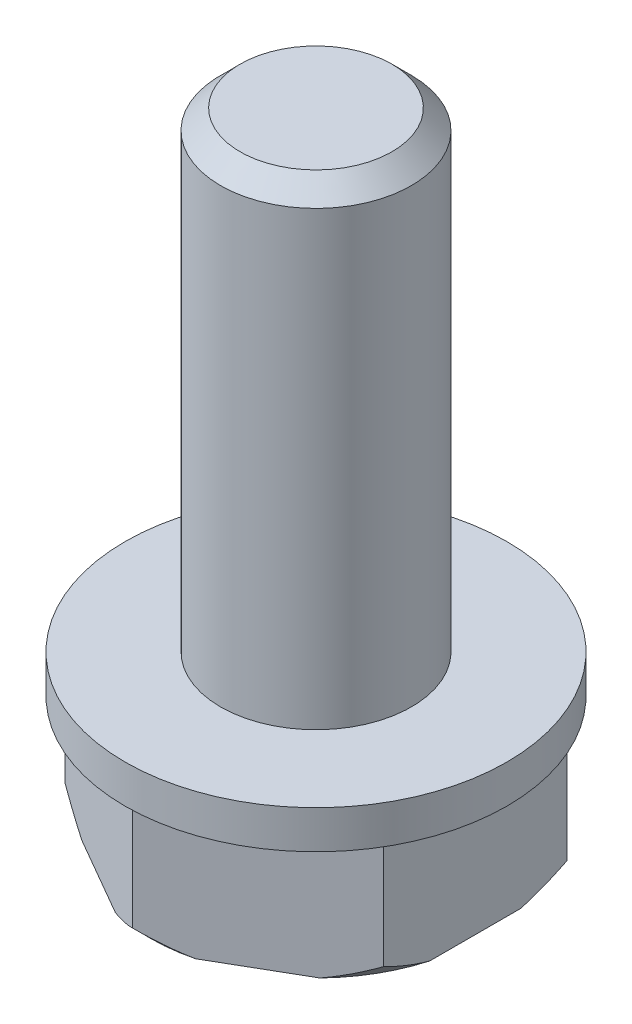
ISO-10303-21;
HEADER;
FILE_DESCRIPTION(('STEP AP214'),'2;1');
FILE_NAME('part.step','',(''),(''),'','','');
FILE_SCHEMA(('AUTOMOTIVE_DESIGN { 1 0 10303 214 1 1 1 1 }'));
ENDSEC;
DATA;
#1=APPLICATION_CONTEXT('core data for automotive mechanical design processes');
#2=APPLICATION_PROTOCOL_DEFINITION('international standard','automotive_design',2000,#1);
#3=PRODUCT_CONTEXT('',#1,'mechanical');
#4=PRODUCT('Part','Part','',(#3));
#5=PRODUCT_RELATED_PRODUCT_CATEGORY('part','',(#4));
#6=PRODUCT_DEFINITION_FORMATION('','',#4);
#7=PRODUCT_DEFINITION_CONTEXT('part definition',#1,'design');
#8=PRODUCT_DEFINITION('design','',#6,#7);
#9=PRODUCT_DEFINITION_SHAPE('','',#8);
#10=(LENGTH_UNIT() NAMED_UNIT(*) SI_UNIT(.MILLI.,.METRE.));
#11=(NAMED_UNIT(*) PLANE_ANGLE_UNIT() SI_UNIT($,.RADIAN.));
#12=(NAMED_UNIT(*) SI_UNIT($,.STERADIAN.) SOLID_ANGLE_UNIT());
#13=UNCERTAINTY_MEASURE_WITH_UNIT(LENGTH_MEASURE(1.E-05),#10,'distance_accuracy_value','');
#14=(GEOMETRIC_REPRESENTATION_CONTEXT(3) GLOBAL_UNCERTAINTY_ASSIGNED_CONTEXT((#13)) GLOBAL_UNIT_ASSIGNED_CONTEXT((#10,
#11,#12)) REPRESENTATION_CONTEXT('',''));
#15=CARTESIAN_POINT('',(0.,0.,0.));
#16=DIRECTION('',(0.,0.,1.));
#17=DIRECTION('',(1.,0.,0.));
#18=AXIS2_PLACEMENT_3D('',#15,#16,#17);
#19=CARTESIAN_POINT('',(-12.6776695296637,96.,14.7909181837156));
#20=DIRECTION('',(-0.5,0.,0.866025403784439));
#21=DIRECTION('',(0.866025403784439,0.,0.5));
#22=AXIS2_PLACEMENT_3D('',#19,#20,#21);
#23=PLANE('',#22);
#24=DIRECTION('',(0.,-1.,0.));
#25=VECTOR('',#24,1.);
#26=CARTESIAN_POINT('',(-12.6776695296637,96.,14.7909181837156));
#27=LINE('',#26,#25);
#28=CARTESIAN_POINT('',(-12.6776695296637,50.,14.7909181837156));
#29=VERTEX_POINT('',#28);
#30=CARTESIAN_POINT('',(-12.6776695296637,46.5735026918963,14.7909181837156));
#31=VERTEX_POINT('',#30);
#32=EDGE_CURVE('E11',#29,#31,#27,.T.);
#33=ORIENTED_EDGE('',*,*,#32,.T.);
#34=CARTESIAN_POINT('',(-13.9407378419784,46.,14.0616853535958));
#35=CARTESIAN_POINT('',(-13.8888852998626,46.0164440766261,14.091623938227));
#36=CARTESIAN_POINT('',(-13.8372495435169,46.0337687545802,14.1214486324146));
#37=CARTESIAN_POINT('',(-13.7338516018748,46.0702823086314,14.1811796574282));
#38=CARTESIAN_POINT('',(-13.6820943622336,46.0894897238432,14.2110832271335));
#39=CARTESIAN_POINT('',(-13.5783633971793,46.1297670931507,14.2710096812821));
#40=CARTESIAN_POINT('',(-13.5263958373999,46.1508582920278,14.3010289273304));
#41=CARTESIAN_POINT('',(-13.4221600511645,46.1949003649628,14.3612296351021));
#42=CARTESIAN_POINT('',(-13.3698991333133,46.2178745106764,14.3914067018588));
#43=CARTESIAN_POINT('',(-13.2649997798865,46.2656807395659,14.4519664939412));
#44=CARTESIAN_POINT('',(-13.212369709376,46.2905375181192,14.4823441822286));
#45=CARTESIAN_POINT('',(-13.1066617384088,46.3421079012049,14.5433494931069));
#46=CARTESIAN_POINT('',(-13.0535931424492,46.3688470805479,14.5739715894766));
#47=CARTESIAN_POINT('',(-12.9469443837856,46.4241810640024,14.6355096377957));
#48=CARTESIAN_POINT('',(-12.8933743396931,46.4528018406309,14.6664197250956));
#49=CARTESIAN_POINT('',(-12.7856642307774,46.5119007649667,14.7285774640249));
#50=CARTESIAN_POINT('',(-12.7315349477506,46.5424049416879,14.7598190718213));
#51=CARTESIAN_POINT('',(-12.6776695296637,46.5735026918963,14.7909181837156));
#52=B_SPLINE_CURVE_WITH_KNOTS('',3,(#34,#35,#36,#37,#38,#39,#40,#41,#42,#43,#44,#45,#46,#47,#48,
#49,#50,#51),.UNSPECIFIED.,.F.,.F.,(4,2,2,2,2,2,2,2,4),(0.,0.186265222277087,0.374595608167021,
0.565412784427934,0.759111232115696,0.956057798253864,1.15659171756842,1.36102506604504,
1.56964356219137),.UNSPECIFIED.);
#53=CARTESIAN_POINT('',(-13.9407378419784,46.,14.0616853535958));
#54=VERTEX_POINT('',#53);
#55=EDGE_CURVE('E126',#54,#31,#52,.T.);
#56=ORIENTED_EDGE('',*,*,#55,.F.);
#57=DIRECTION('',(0.866025403784439,0.,0.5));
#58=VECTOR('',#57,1.);
#59=CARTESIAN_POINT('',(-11.2776695296637,46.,15.5992085605811));
#60=LINE('',#59,#58);
#61=CARTESIAN_POINT('',(-16.414601217349,46.,12.6333996678872));
#62=VERTEX_POINT('',#61);
#63=EDGE_CURVE('E147',#62,#54,#60,.T.);
#64=ORIENTED_EDGE('',*,*,#63,.F.);
#65=CARTESIAN_POINT('',(-17.6776695296637,46.5735026918963,11.9041668377674));
#66=CARTESIAN_POINT('',(-17.6238041996847,46.5424049416879,11.9352661022691));
#67=CARTESIAN_POINT('',(-17.5696835321645,46.5119007649667,11.9665226325607));
#68=CARTESIAN_POINT('',(-17.4619982967521,46.4528018406309,12.0287234536614));
#69=CARTESIAN_POINT('',(-17.4084443538709,46.4241810640024,12.0596614290774));
#70=CARTESIAN_POINT('',(-17.3018264613955,46.3688470805479,12.1212529392026));
#71=CARTESIAN_POINT('',(-17.2487726500423,46.3421079012049,12.1519006432619));
#72=CARTESIAN_POINT('',(-17.1430865155724,46.2905375181192,12.2129437760629));
#73=CARTESIAN_POINT('',(-17.090463630552,46.2656807395659,12.2433339099843));
#74=CARTESIAN_POINT('',(-16.9855676354473,46.2178745106764,12.3038995188512));
#75=CARTESIAN_POINT('',(-16.9333030700988,46.1949003649628,12.3340702679571));
#76=CARTESIAN_POINT('',(-16.829049834725,46.1508582920278,12.3942407529346));
#77=CARTESIAN_POINT('',(-16.7770686251549,46.1297670931507,12.424236356852));
#78=CARTESIAN_POINT('',(-16.6733053109764,46.0894897238432,12.4841067806739));
#79=CARTESIAN_POINT('',(-16.6215294401272,46.0702823086314,12.5139780801803));
#80=CARTESIAN_POINT('',(-16.5181018842503,46.0337687545802,12.5736578118346));
#81=CARTESIAN_POINT('',(-16.4664550632509,46.0164440766261,12.6034633414798));
#82=CARTESIAN_POINT('',(-16.414601217349,46.,12.6333996678872));
#83=B_SPLINE_CURVE_WITH_KNOTS('',3,(#65,#66,#67,#68,#69,#70,#71,#72,#73,#74,#75,#76,#77,#78,#79,
#80,#81,#82),.UNSPECIFIED.,.F.,.F.,(4,2,2,2,2,2,2,2,4),(0.,0.208618496146344,0.413051844622972,
0.613585763937534,0.810532330075705,1.00423077776347,1.19504795402439,1.38337833991431,
1.56964356219139),.UNSPECIFIED.);
#84=CARTESIAN_POINT('',(-17.6776695296637,46.5735026918963,11.9041668377674));
#85=VERTEX_POINT('',#84);
#86=EDGE_CURVE('E341',#85,#62,#83,.T.);
#87=ORIENTED_EDGE('',*,*,#86,.F.);
#88=DIRECTION('',(0.,-1.,0.));
#89=VECTOR('',#88,1.);
#90=CARTESIAN_POINT('',(-17.6776695296637,96.,11.9041668377674));
#91=LINE('',#90,#89);
#92=CARTESIAN_POINT('',(-17.6776695296637,50.,11.9041668377674));
#93=VERTEX_POINT('',#92);
#94=EDGE_CURVE('E365',#93,#85,#91,.T.);
#95=ORIENTED_EDGE('',*,*,#94,.F.);
#96=DIRECTION('',(-0.866025403784439,0.,-0.5));
#97=VECTOR('',#96,1.);
#98=CARTESIAN_POINT('',(-12.9276695296637,50.,14.6465806164181));
#99=LINE('',#98,#97);
#100=EDGE_CURVE('E352',#29,#93,#99,.T.);
#101=ORIENTED_EDGE('',*,*,#100,.F.);
#102=EDGE_LOOP('',(#33,#56,#64,#87,#95,#101));
#103=FACE_BOUND('',#102,.T.);
#104=ADVANCED_FACE('F16',(#103),#23,.F.);
#105=CARTESIAN_POINT('',(-12.6776695296637,96.,20.5644208756118));
#106=DIRECTION('',(-1.,0.,0.));
#107=DIRECTION('',(0.,0.,1.));
#108=AXIS2_PLACEMENT_3D('',#105,#106,#107);
#109=PLANE('',#108);
#110=DIRECTION('',(0.,-1.,0.));
#111=VECTOR('',#110,1.);
#112=CARTESIAN_POINT('',(-12.6776695296637,96.,20.5644208756118));
#113=LINE('',#112,#111);
#114=CARTESIAN_POINT('',(-12.6776695296637,50.,20.5644208756118));
#115=VERTEX_POINT('',#114);
#116=CARTESIAN_POINT('',(-12.6776695296637,46.5735026918963,20.5644208756118));
#117=VERTEX_POINT('',#116);
#118=EDGE_CURVE('E214',#115,#117,#113,.T.);
#119=ORIENTED_EDGE('',*,*,#118,.T.);
#120=CARTESIAN_POINT('',(-12.6776695296637,46.,19.1059552153723));
#121=CARTESIAN_POINT('',(-12.6776708334498,46.0164440766261,19.1658301264109));
#122=CARTESIAN_POINT('',(-12.6776818981035,46.0337687545802,19.2254603502437));
#123=CARTESIAN_POINT('',(-12.6777115123383,46.0702823086314,19.3448711069116));
#124=CARTESIAN_POINT('',(-12.6777301435463,46.0894897238432,19.4046459761233));
#125=CARTESIAN_POINT('',(-12.6777624926705,46.1297670931507,19.5244428540937));
#126=CARTESIAN_POINT('',(-12.6777761424612,46.1508582920278,19.5844577040596));
#127=CARTESIAN_POINT('',(-12.6777935915996,46.1949003649628,19.7048288968087));
#128=CARTESIAN_POINT('',(-12.677797239097,46.2178745106764,19.7651767126713));
#129=CARTESIAN_POINT('',(-12.6777938807748,46.2656807395659,19.8863021136206));
#130=CARTESIAN_POINT('',(-12.6777866952847,46.2905375181192,19.9470699358293));
#131=CARTESIAN_POINT('',(-12.6777648587874,46.3421079012049,20.0691183795086));
#132=CARTESIAN_POINT('',(-12.677750074181,46.3688470805479,20.1303881799377));
#133=CARTESIAN_POINT('',(-12.6777192079928,46.4241810640024,20.2535177383819));
#134=CARTESIAN_POINT('',(-12.6777031067814,46.4528018406309,20.3153658010979));
#135=CARTESIAN_POINT('',(-12.6776782332782,46.5119007649667,20.4397243611279));
#136=CARTESIAN_POINT('',(-12.6776696177716,46.542404941688,20.502222499216));
#137=CARTESIAN_POINT('',(-12.6776695296637,46.5735026918963,20.5644208756118));
#138=B_SPLINE_CURVE_WITH_KNOTS('',3,(#120,#121,#122,#123,#124,#125,#126,#127,#128,#129,#130,
#131,#132,#133,#134,#135,#136,#137),.UNSPECIFIED.,.F.,.F.,(4,2,2,2,2,2,2,2,4),(0.,
0.186265222277086,0.37459560816702,0.565412784427932,0.759111232115696,0.956057798253867,
1.15659171756843,1.36102506604505,1.56964356219139),.UNSPECIFIED.);
#139=CARTESIAN_POINT('',(-12.6776695296637,46.,19.1059552153723));
#140=VERTEX_POINT('',#139);
#141=EDGE_CURVE('E28',#140,#117,#138,.T.);
#142=ORIENTED_EDGE('',*,*,#141,.F.);
#143=DIRECTION('',(0.,0.,1.));
#144=VECTOR('',#143,1.);
#145=CARTESIAN_POINT('',(-12.6776695296637,46.,17.6776695296637));
#146=LINE('',#145,#144);
#147=CARTESIAN_POINT('',(-12.6776695296637,46.,16.2493838439551));
#148=VERTEX_POINT('',#147);
#149=EDGE_CURVE('E133',#148,#140,#146,.T.);
#150=ORIENTED_EDGE('',*,*,#149,.F.);
#151=CARTESIAN_POINT('',(-12.6776695296637,46.5735026918963,14.7909181837156));
#152=CARTESIAN_POINT('',(-12.6776696177716,46.5424049416879,14.8531165601115));
#153=CARTESIAN_POINT('',(-12.6776782332782,46.5119007649667,14.9156146981996));
#154=CARTESIAN_POINT('',(-12.6777031067814,46.4528018406309,15.0399732582295));
#155=CARTESIAN_POINT('',(-12.6777192079928,46.4241810640024,15.1018213209455));
#156=CARTESIAN_POINT('',(-12.677750074181,46.3688470805479,15.2249508793897));
#157=CARTESIAN_POINT('',(-12.6777648587874,46.3421079012049,15.2862206798188));
#158=CARTESIAN_POINT('',(-12.6777866952847,46.2905375181192,15.4082691234981));
#159=CARTESIAN_POINT('',(-12.6777938807748,46.2656807395659,15.4690369457068));
#160=CARTESIAN_POINT('',(-12.677797239097,46.2178745106764,15.5901623466562));
#161=CARTESIAN_POINT('',(-12.6777935915996,46.1949003649628,15.6505101625187));
#162=CARTESIAN_POINT('',(-12.6777761424612,46.1508582920278,15.7708813552679));
#163=CARTESIAN_POINT('',(-12.6777624926706,46.1297670931507,15.8308962052337));
#164=CARTESIAN_POINT('',(-12.6777301435463,46.0894897238432,15.9506930832041));
#165=CARTESIAN_POINT('',(-12.6777115123383,46.0702823086314,16.0104679524158));
#166=CARTESIAN_POINT('',(-12.6776818981035,46.0337687545802,16.1298787090837));
#167=CARTESIAN_POINT('',(-12.6776708334498,46.0164440766261,16.1895089329165));
#168=CARTESIAN_POINT('',(-12.6776695296637,46.,16.2493838439551));
#169=B_SPLINE_CURVE_WITH_KNOTS('',3,(#151,#152,#153,#154,#155,#156,#157,#158,#159,#160,#161,
#162,#163,#164,#165,#166,#167,#168),.UNSPECIFIED.,.F.,.F.,(4,2,2,2,2,2,2,2,4),(0.,
0.208618496146355,0.413051844622992,0.613585763937557,0.810532330075726,1.00423077776349,
1.19504795402439,1.38337833991431,1.56964356219138),.UNSPECIFIED.);
#170=EDGE_CURVE('E119',#31,#148,#169,.T.);
#171=ORIENTED_EDGE('',*,*,#170,.F.);
#172=ORIENTED_EDGE('',*,*,#32,.F.);
#173=DIRECTION('',(0.,0.,-1.));
#174=VECTOR('',#173,1.);
#175=CARTESIAN_POINT('',(-12.6776695296637,50.,17.6776695296637));
#176=LINE('',#175,#174);
#177=EDGE_CURVE('E337',#115,#29,#176,.T.);
#178=ORIENTED_EDGE('',*,*,#177,.F.);
#179=EDGE_LOOP('',(#119,#142,#150,#171,#172,#178));
#180=FACE_BOUND('',#179,.T.);
#181=ADVANCED_FACE('F135',(#180),#109,.F.);
#182=CARTESIAN_POINT('',(-17.6776695296637,46.8,17.6776695296637));
#183=DIRECTION('',(0.,1.,0.));
#184=DIRECTION('',(0.,0.,1.));
#185=AXIS2_PLACEMENT_3D('',#182,#183,#184);
#186=CONICAL_SURFACE('',#185,6.,0.785398163397448);
#187=CARTESIAN_POINT('',(-17.6776695296637,46.,17.6776695296637));
#188=DIRECTION('',(0.,-1.,0.));
#189=DIRECTION('',(0.,0.,-1.));
#190=AXIS2_PLACEMENT_3D('',#187,#188,#189);
#191=CIRCLE('',#190,5.2);
#192=CARTESIAN_POINT('',(-13.9407378419784,46.,21.2936537057316));
#193=VERTEX_POINT('',#192);
#194=EDGE_CURVE('E141',#140,#193,#191,.T.);
#195=ORIENTED_EDGE('',*,*,#194,.F.);
#196=ORIENTED_EDGE('',*,*,#141,.T.);
#197=CARTESIAN_POINT('',(-12.6776695296637,46.5735026918963,20.5644208756118));
#198=CARTESIAN_POINT('',(-12.7315349477506,46.542404941688,20.5955199875061));
#199=CARTESIAN_POINT('',(-12.7856642307775,46.5119007649667,20.6267615953026));
#200=CARTESIAN_POINT('',(-12.8933743396931,46.4528018406309,20.6889193342319));
#201=CARTESIAN_POINT('',(-12.9469443837857,46.4241810640024,20.7198294215318));
#202=CARTESIAN_POINT('',(-13.0535931424492,46.3688470805479,20.7813674698508));
#203=CARTESIAN_POINT('',(-13.1066617384088,46.3421079012049,20.8119895662206));
#204=CARTESIAN_POINT('',(-13.2123697093761,46.2905375181192,20.8729948770988));
#205=CARTESIAN_POINT('',(-13.2649997798865,46.2656807395659,20.9033725653862));
#206=CARTESIAN_POINT('',(-13.3698991333133,46.2178745106764,20.9639323574686));
#207=CARTESIAN_POINT('',(-13.4221600511645,46.1949003649628,20.9941094242253));
#208=CARTESIAN_POINT('',(-13.5263958373999,46.1508582920278,21.054310131997));
#209=CARTESIAN_POINT('',(-13.5783633971793,46.1297670931507,21.0843293780454));
#210=CARTESIAN_POINT('',(-13.6820943622336,46.0894897238432,21.1442558321939));
#211=CARTESIAN_POINT('',(-13.7338516018749,46.0702823086314,21.1741594018992));
#212=CARTESIAN_POINT('',(-13.8372495435169,46.0337687545802,21.2338904269128));
#213=CARTESIAN_POINT('',(-13.8888852998626,46.0164440766261,21.2637151211004));
#214=CARTESIAN_POINT('',(-13.9407378419784,46.,21.2936537057316));
#215=B_SPLINE_CURVE_WITH_KNOTS('',3,(#197,#198,#199,#200,#201,#202,#203,#204,#205,#206,#207,
#208,#209,#210,#211,#212,#213,#214),.UNSPECIFIED.,.F.,.F.,(4,2,2,2,2,2,2,2,4),(0.,
0.208618496146344,0.413051844622971,0.61358576393753,0.810532330075699,1.00423077776346,
1.19504795402437,1.3833783399143,1.56964356219137),.UNSPECIFIED.);
#216=EDGE_CURVE('E216',#117,#193,#215,.T.);
#217=ORIENTED_EDGE('',*,*,#216,.T.);
#218=EDGE_LOOP('',(#195,#196,#217));
#219=FACE_BOUND('',#218,.T.);
#220=ADVANCED_FACE('F169',(#219),#186,.T.);
#221=CARTESIAN_POINT('',(-17.6776695296637,46.8,17.6776695296637));
#222=DIRECTION('',(0.,1.,0.));
#223=DIRECTION('',(0.,0.,1.));
#224=AXIS2_PLACEMENT_3D('',#221,#222,#223);
#225=CONICAL_SURFACE('',#224,6.,0.785398163397448);
#226=CARTESIAN_POINT('',(-17.6776695296637,46.,17.6776695296637));
#227=DIRECTION('',(0.,-1.,0.));
#228=DIRECTION('',(0.,0.,-1.));
#229=AXIS2_PLACEMENT_3D('',#226,#227,#228);
#230=CIRCLE('',#229,5.2);
#231=EDGE_CURVE('E124',#54,#148,#230,.T.);
#232=ORIENTED_EDGE('',*,*,#231,.F.);
#233=ORIENTED_EDGE('',*,*,#55,.T.);
#234=ORIENTED_EDGE('',*,*,#170,.T.);
#235=EDGE_LOOP('',(#232,#233,#234));
#236=FACE_BOUND('',#235,.T.);
#237=ADVANCED_FACE('F122',(#236),#225,.T.);
#238=CARTESIAN_POINT('',(-17.6776695296637,46.8,17.6776695296637));
#239=DIRECTION('',(0.,1.,0.));
#240=DIRECTION('',(0.,0.,1.));
#241=AXIS2_PLACEMENT_3D('',#238,#239,#240);
#242=CONICAL_SURFACE('',#241,6.,0.785398163397448);
#243=CARTESIAN_POINT('',(-17.6776695296637,46.,17.6776695296637));
#244=DIRECTION('',(0.,-1.,0.));
#245=DIRECTION('',(0.,0.,-1.));
#246=AXIS2_PLACEMENT_3D('',#243,#244,#245);
#247=CIRCLE('',#246,5.2);
#248=CARTESIAN_POINT('',(-18.9407378419784,46.,12.6333996678872));
#249=VERTEX_POINT('',#248);
#250=EDGE_CURVE('E149',#249,#62,#247,.T.);
#251=ORIENTED_EDGE('',*,*,#250,.F.);
#252=CARTESIAN_POINT('',(-18.9407378419784,46.,12.6333996678872));
#253=CARTESIAN_POINT('',(-18.8888839960765,46.0164440766261,12.6034633414798));
#254=CARTESIAN_POINT('',(-18.8372371750771,46.0337687545802,12.5736578118346));
#255=CARTESIAN_POINT('',(-18.7338096192002,46.0702823086314,12.5139780801803));
#256=CARTESIAN_POINT('',(-18.682033748351,46.0894897238432,12.4841067806739));
#257=CARTESIAN_POINT('',(-18.5782704341724,46.1297670931507,12.424236356852));
#258=CARTESIAN_POINT('',(-18.5262892246024,46.1508582920278,12.3942407529346));
#259=CARTESIAN_POINT('',(-18.4220359892286,46.1949003649628,12.3340702679571));
#260=CARTESIAN_POINT('',(-18.36977142388,46.2178745106764,12.3038995188512));
#261=CARTESIAN_POINT('',(-18.2648754287754,46.2656807395659,12.2433339099842));
#262=CARTESIAN_POINT('',(-18.212252543755,46.2905375181192,12.2129437760629));
#263=CARTESIAN_POINT('',(-18.1065664092851,46.3421079012049,12.1519006432619));
#264=CARTESIAN_POINT('',(-18.0535125979319,46.3688470805479,12.1212529392026));
#265=CARTESIAN_POINT('',(-17.9468947054565,46.4241810640024,12.0596614290774));
#266=CARTESIAN_POINT('',(-17.8933407625753,46.4528018406309,12.0287234536614));
#267=CARTESIAN_POINT('',(-17.7856555271629,46.5119007649667,11.9665226325607));
#268=CARTESIAN_POINT('',(-17.7315348596427,46.542404941688,11.9352661022691));
#269=CARTESIAN_POINT('',(-17.6776695296637,46.5735026918963,11.9041668377675));
#270=B_SPLINE_CURVE_WITH_KNOTS('',3,(#252,#253,#254,#255,#256,#257,#258,#259,#260,#261,#262,
#263,#264,#265,#266,#267,#268,#269),.UNSPECIFIED.,.F.,.F.,(4,2,2,2,2,2,2,2,4),(0.,
0.186265222277084,0.37459560816702,0.565412784427932,0.759111232115701,0.956057798253868,
1.15659171756843,1.36102506604505,1.56964356219139),.UNSPECIFIED.);
#271=EDGE_CURVE('E85',#249,#85,#270,.T.);
#272=ORIENTED_EDGE('',*,*,#271,.T.);
#273=ORIENTED_EDGE('',*,*,#86,.T.);
#274=EDGE_LOOP('',(#251,#272,#273));
#275=FACE_BOUND('',#274,.T.);
#276=ADVANCED_FACE('F168',(#275),#242,.T.);
#277=CARTESIAN_POINT('',(-17.6776695296637,51.2,17.6776695296637));
#278=DIRECTION('',(0.,-1.,0.));
#279=DIRECTION('',(0.,0.,-1.));
#280=AXIS2_PLACEMENT_3D('',#277,#278,#279);
#281=PLANE('',#280);
#282=CARTESIAN_POINT('',(-17.6776695296637,51.2,17.6776695296637));
#283=DIRECTION('',(0.,-1.,0.));
#284=DIRECTION('',(0.,0.,-1.));
#285=AXIS2_PLACEMENT_3D('',#282,#283,#284);
#286=CIRCLE('',#285,3.);
#287=CARTESIAN_POINT('',(-17.6776695296637,51.2,14.6776695296637));
#288=VERTEX_POINT('',#287);
#289=EDGE_CURVE('E342',#288,#288,#286,.T.);
#290=ORIENTED_EDGE('',*,*,#289,.T.);
#291=EDGE_LOOP('',(#290));
#292=FACE_BOUND('',#291,.T.);
#293=CARTESIAN_POINT('',(-17.6776695296637,51.2,17.6776695296637));
#294=DIRECTION('',(0.,-1.,0.));
#295=DIRECTION('',(0.,0.,-1.));
#296=AXIS2_PLACEMENT_3D('',#293,#294,#295);
#297=CIRCLE('',#296,6.);
#298=CARTESIAN_POINT('',(-17.6776695296637,51.2,11.6776695296637));
#299=VERTEX_POINT('',#298);
#300=EDGE_CURVE('E339',#299,#299,#297,.T.);
#301=ORIENTED_EDGE('',*,*,#300,.F.);
#302=EDGE_LOOP('',(#301));
#303=FACE_BOUND('',#302,.T.);
#304=ADVANCED_FACE('F196',(#292,#303),#281,.F.);
#305=CARTESIAN_POINT('',(-17.6776695296637,46.8,17.6776695296637));
#306=DIRECTION('',(0.,1.,0.));
#307=DIRECTION('',(0.,0.,1.));
#308=AXIS2_PLACEMENT_3D('',#305,#306,#307);
#309=CONICAL_SURFACE('',#308,6.,0.785398163397448);
#310=CARTESIAN_POINT('',(-17.6776695296637,46.,17.6776695296637));
#311=DIRECTION('',(0.,-1.,0.));
#312=DIRECTION('',(0.,0.,-1.));
#313=AXIS2_PLACEMENT_3D('',#310,#311,#312);
#314=CIRCLE('',#313,5.2);
#315=CARTESIAN_POINT('',(-22.6776695296637,46.,16.2493838439551));
#316=VERTEX_POINT('',#315);
#317=CARTESIAN_POINT('',(-21.414601217349,46.,14.0616853535958));
#318=VERTEX_POINT('',#317);
#319=EDGE_CURVE('E446',#316,#318,#314,.T.);
#320=ORIENTED_EDGE('',*,*,#319,.F.);
#321=CARTESIAN_POINT('',(-22.6776695296637,46.,16.2493838439551));
#322=CARTESIAN_POINT('',(-22.6776682258776,46.0164440766261,16.1895089329165));
#323=CARTESIAN_POINT('',(-22.6776571612239,46.0337687545802,16.1298787090837));
#324=CARTESIAN_POINT('',(-22.6776275469891,46.0702823086314,16.0104679524158));
#325=CARTESIAN_POINT('',(-22.6776089157811,46.0894897238432,15.9506930832041));
#326=CARTESIAN_POINT('',(-22.6775765666569,46.1297670931507,15.8308962052337));
#327=CARTESIAN_POINT('',(-22.6775629168662,46.1508582920278,15.7708813552678));
#328=CARTESIAN_POINT('',(-22.6775454677278,46.1949003649628,15.6505101625187));
#329=CARTESIAN_POINT('',(-22.6775418202304,46.2178745106764,15.5901623466562));
#330=CARTESIAN_POINT('',(-22.6775451785526,46.2656807395659,15.4690369457068));
#331=CARTESIAN_POINT('',(-22.6775523640427,46.2905375181192,15.4082691234981));
#332=CARTESIAN_POINT('',(-22.67757420054,46.3421079012049,15.2862206798188));
#333=CARTESIAN_POINT('',(-22.6775889851464,46.3688470805479,15.2249508793897));
#334=CARTESIAN_POINT('',(-22.6776198513346,46.4241810640024,15.1018213209455));
#335=CARTESIAN_POINT('',(-22.677635952546,46.4528018406309,15.0399732582295));
#336=CARTESIAN_POINT('',(-22.6776608260492,46.5119007649667,14.9156146981995));
#337=CARTESIAN_POINT('',(-22.6776694415558,46.542404941688,14.8531165601114));
#338=CARTESIAN_POINT('',(-22.6776695296637,46.5735026918963,14.7909181837156));
#339=B_SPLINE_CURVE_WITH_KNOTS('',3,(#321,#322,#323,#324,#325,#326,#327,#328,#329,#330,#331,
#332,#333,#334,#335,#336,#337,#338),.UNSPECIFIED.,.F.,.F.,(4,2,2,2,2,2,2,2,4),(0.,
0.186265222277089,0.37459560816702,0.565412784427928,0.759111232115701,0.95605779825387,
1.15659171756843,1.36102506604505,1.56964356219139),.UNSPECIFIED.);
#340=CARTESIAN_POINT('',(-22.6776695296637,46.5735026918963,14.7909181837156));
#341=VERTEX_POINT('',#340);
#342=EDGE_CURVE('E367',#316,#341,#339,.T.);
#343=ORIENTED_EDGE('',*,*,#342,.T.);
#344=CARTESIAN_POINT('',(-22.6776695296637,46.5735026918963,14.7909181837156));
#345=CARTESIAN_POINT('',(-22.6238041115768,46.542404941688,14.7598190718213));
#346=CARTESIAN_POINT('',(-22.56967482855,46.5119007649667,14.7285774640249));
#347=CARTESIAN_POINT('',(-22.4619647196343,46.4528018406309,14.6664197250956));
#348=CARTESIAN_POINT('',(-22.4083946755418,46.4241810640024,14.6355096377956));
#349=CARTESIAN_POINT('',(-22.3017459168782,46.3688470805479,14.5739715894766));
#350=CARTESIAN_POINT('',(-22.2486773209186,46.3421079012049,14.5433494931068));
#351=CARTESIAN_POINT('',(-22.1429693499514,46.2905375181192,14.4823441822286));
#352=CARTESIAN_POINT('',(-22.0903392794409,46.2656807395659,14.4519664939412));
#353=CARTESIAN_POINT('',(-21.9854399260141,46.2178745106764,14.3914067018588));
#354=CARTESIAN_POINT('',(-21.9331790081629,46.1949003649628,14.3612296351021));
#355=CARTESIAN_POINT('',(-21.8289432219275,46.1508582920278,14.3010289273304));
#356=CARTESIAN_POINT('',(-21.7769756621481,46.1297670931507,14.2710096812821));
#357=CARTESIAN_POINT('',(-21.6732446970938,46.0894897238432,14.2110832271335));
#358=CARTESIAN_POINT('',(-21.6214874574526,46.0702823086314,14.1811796574282));
#359=CARTESIAN_POINT('',(-21.5180895158105,46.0337687545802,14.1214486324146));
#360=CARTESIAN_POINT('',(-21.4664537594648,46.0164440766261,14.091623938227));
#361=CARTESIAN_POINT('',(-21.414601217349,46.,14.0616853535958));
#362=B_SPLINE_CURVE_WITH_KNOTS('',3,(#344,#345,#346,#347,#348,#349,#350,#351,#352,#353,#354,
#355,#356,#357,#358,#359,#360,#361),.UNSPECIFIED.,.F.,.F.,(4,2,2,2,2,2,2,2,4),(0.,
0.208618496146339,0.413051844622965,0.613585763937522,0.810532330075695,1.00423077776345,
1.19504795402436,1.38337833991429,1.56964356219137),.UNSPECIFIED.);
#363=EDGE_CURVE('E77',#341,#318,#362,.T.);
#364=ORIENTED_EDGE('',*,*,#363,.T.);
#365=EDGE_LOOP('',(#320,#343,#364));
#366=FACE_BOUND('',#365,.T.);
#367=ADVANCED_FACE('F321',(#366),#309,.T.);
#368=CARTESIAN_POINT('',(-17.6776695296637,50.,17.6776695296637));
#369=DIRECTION('',(0.,-1.,0.));
#370=DIRECTION('',(0.,0.,-1.));
#371=AXIS2_PLACEMENT_3D('',#368,#369,#370);
#372=CYLINDRICAL_SURFACE('',#371,6.);
#373=ORIENTED_EDGE('',*,*,#300,.T.);
#374=EDGE_LOOP('',(#373));
#375=FACE_BOUND('',#374,.T.);
#376=CARTESIAN_POINT('',(-17.6776695296637,50.,17.6776695296637));
#377=DIRECTION('',(0.,-1.,0.));
#378=DIRECTION('',(0.,0.,-1.));
#379=AXIS2_PLACEMENT_3D('',#376,#377,#378);
#380=CIRCLE('',#379,6.);
#381=CARTESIAN_POINT('',(-17.6776695296637,50.,11.6776695296637));
#382=VERTEX_POINT('',#381);
#383=EDGE_CURVE('E345',#382,#382,#380,.T.);
#384=ORIENTED_EDGE('',*,*,#383,.F.);
#385=EDGE_LOOP('',(#384));
#386=FACE_BOUND('',#385,.T.);
#387=ADVANCED_FACE('F265',(#375,#386),#372,.T.);
#388=CARTESIAN_POINT('',(-17.6776695296637,96.,11.9041668377674));
#389=DIRECTION('',(0.5,0.,0.866025403784439));
#390=DIRECTION('',(0.866025403784439,0.,-0.5));
#391=AXIS2_PLACEMENT_3D('',#388,#389,#390);
#392=PLANE('',#391);
#393=ORIENTED_EDGE('',*,*,#94,.T.);
#394=ORIENTED_EDGE('',*,*,#271,.F.);
#395=DIRECTION('',(0.866025403784439,0.,-0.5));
#396=VECTOR('',#395,1.);
#397=CARTESIAN_POINT('',(-16.2776695296637,46.,11.095876460902));
#398=LINE('',#397,#396);
#399=EDGE_CURVE('E449',#318,#249,#398,.T.);
#400=ORIENTED_EDGE('',*,*,#399,.F.);
#401=ORIENTED_EDGE('',*,*,#363,.F.);
#402=DIRECTION('',(0.,-1.,0.));
#403=VECTOR('',#402,1.);
#404=CARTESIAN_POINT('',(-22.6776695296637,96.,14.7909181837156));
#405=LINE('',#404,#403);
#406=CARTESIAN_POINT('',(-22.6776695296637,50.,14.7909181837156));
#407=VERTEX_POINT('',#406);
#408=EDGE_CURVE('E347',#407,#341,#405,.T.);
#409=ORIENTED_EDGE('',*,*,#408,.F.);
#410=DIRECTION('',(-0.866025403784439,0.,0.5));
#411=VECTOR('',#410,1.);
#412=CARTESIAN_POINT('',(-17.9276695296637,50.,12.0485044050648));
#413=LINE('',#412,#411);
#414=EDGE_CURVE('E349',#93,#407,#413,.T.);
#415=ORIENTED_EDGE('',*,*,#414,.F.);
#416=EDGE_LOOP('',(#393,#394,#400,#401,#409,#415));
#417=FACE_BOUND('',#416,.T.);
#418=ADVANCED_FACE('F262',(#417),#392,.F.);
#419=CARTESIAN_POINT('',(-22.6776695296637,96.,14.7909181837156));
#420=DIRECTION('',(1.,0.,0.));
#421=DIRECTION('',(0.,0.,-1.));
#422=AXIS2_PLACEMENT_3D('',#419,#420,#421);
#423=PLANE('',#422);
#424=ORIENTED_EDGE('',*,*,#408,.T.);
#425=ORIENTED_EDGE('',*,*,#342,.F.);
#426=DIRECTION('',(0.,0.,-1.));
#427=VECTOR('',#426,1.);
#428=CARTESIAN_POINT('',(-22.6776695296637,46.,17.6776695296637));
#429=LINE('',#428,#427);
#430=CARTESIAN_POINT('',(-22.6776695296637,46.,19.1059552153723));
#431=VERTEX_POINT('',#430);
#432=EDGE_CURVE('E439',#431,#316,#429,.T.);
#433=ORIENTED_EDGE('',*,*,#432,.F.);
#434=CARTESIAN_POINT('',(-22.6776695296637,46.5735026918963,20.5644208756118));
#435=CARTESIAN_POINT('',(-22.6776694415558,46.5424049416879,20.502222499216));
#436=CARTESIAN_POINT('',(-22.6776608260492,46.5119007649667,20.4397243611279));
#437=CARTESIAN_POINT('',(-22.677635952546,46.4528018406309,20.3153658010979));
#438=CARTESIAN_POINT('',(-22.6776198513346,46.4241810640024,20.2535177383819));
#439=CARTESIAN_POINT('',(-22.6775889851464,46.3688470805479,20.1303881799377));
#440=CARTESIAN_POINT('',(-22.67757420054,46.3421079012049,20.0691183795086));
#441=CARTESIAN_POINT('',(-22.6775523640427,46.2905375181192,19.9470699358293));
#442=CARTESIAN_POINT('',(-22.6775451785526,46.2656807395659,19.8863021136206));
#443=CARTESIAN_POINT('',(-22.6775418202304,46.2178745106764,19.7651767126712));
#444=CARTESIAN_POINT('',(-22.6775454677278,46.1949003649628,19.7048288968087));
#445=CARTESIAN_POINT('',(-22.6775629168662,46.1508582920278,19.5844577040595));
#446=CARTESIAN_POINT('',(-22.6775765666568,46.1297670931507,19.5244428540937));
#447=CARTESIAN_POINT('',(-22.6776089157811,46.0894897238432,19.4046459761233));
#448=CARTESIAN_POINT('',(-22.6776275469891,46.0702823086314,19.3448711069116));
#449=CARTESIAN_POINT('',(-22.6776571612239,46.0337687545802,19.2254603502437));
#450=CARTESIAN_POINT('',(-22.6776682258776,46.0164440766261,19.165830126411));
#451=CARTESIAN_POINT('',(-22.6776695296637,46.,19.1059552153723));
#452=B_SPLINE_CURVE_WITH_KNOTS('',3,(#434,#435,#436,#437,#438,#439,#440,#441,#442,#443,#444,
#445,#446,#447,#448,#449,#450,#451),.UNSPECIFIED.,.F.,.F.,(4,2,2,2,2,2,2,2,4),(0.,
0.208618496146364,0.413051844623002,0.613585763937568,0.810532330075742,1.0042307777635,
1.1950479540244,1.38337833991432,1.56964356219138),.UNSPECIFIED.);
#453=CARTESIAN_POINT('',(-22.6776695296637,46.5735026918963,20.5644208756118));
#454=VERTEX_POINT('',#453);
#455=EDGE_CURVE('E344',#454,#431,#452,.T.);
#456=ORIENTED_EDGE('',*,*,#455,.F.);
#457=DIRECTION('',(0.,-1.,0.));
#458=VECTOR('',#457,1.);
#459=CARTESIAN_POINT('',(-22.6776695296637,96.,20.5644208756118));
#460=LINE('',#459,#458);
#461=CARTESIAN_POINT('',(-22.6776695296637,50.,20.5644208756118));
#462=VERTEX_POINT('',#461);
#463=EDGE_CURVE('E221',#462,#454,#460,.T.);
#464=ORIENTED_EDGE('',*,*,#463,.F.);
#465=DIRECTION('',(0.,0.,1.));
#466=VECTOR('',#465,1.);
#467=CARTESIAN_POINT('',(-22.6776695296637,50.,17.6776695296637));
#468=LINE('',#467,#466);
#469=EDGE_CURVE('E348',#407,#462,#468,.T.);
#470=ORIENTED_EDGE('',*,*,#469,.F.);
#471=EDGE_LOOP('',(#424,#425,#433,#456,#464,#470));
#472=FACE_BOUND('',#471,.T.);
#473=ADVANCED_FACE('F375',(#472),#423,.F.);
#474=CARTESIAN_POINT('',(-11.6776695296637,50.,17.6776695296637));
#475=DIRECTION('',(0.,1.,0.));
#476=DIRECTION('',(0.,0.,1.));
#477=AXIS2_PLACEMENT_3D('',#474,#475,#476);
#478=PLANE('',#477);
#479=ORIENTED_EDGE('',*,*,#383,.T.);
#480=EDGE_LOOP('',(#479));
#481=FACE_BOUND('',#480,.T.);
#482=ORIENTED_EDGE('',*,*,#177,.T.);
#483=ORIENTED_EDGE('',*,*,#100,.T.);
#484=ORIENTED_EDGE('',*,*,#414,.T.);
#485=ORIENTED_EDGE('',*,*,#469,.T.);
#486=DIRECTION('',(0.866025403784439,0.,0.5));
#487=VECTOR('',#486,1.);
#488=CARTESIAN_POINT('',(-17.9276695296637,50.,23.3068346542625));
#489=LINE('',#488,#487);
#490=CARTESIAN_POINT('',(-17.6776695296637,50.,23.4511722215599));
#491=VERTEX_POINT('',#490);
#492=EDGE_CURVE('E356',#462,#491,#489,.T.);
#493=ORIENTED_EDGE('',*,*,#492,.T.);
#494=DIRECTION('',(0.866025403784439,0.,-0.5));
#495=VECTOR('',#494,1.);
#496=CARTESIAN_POINT('',(-12.9276695296637,50.,20.7087584429092));
#497=LINE('',#496,#495);
#498=EDGE_CURVE('E215',#491,#115,#497,.T.);
#499=ORIENTED_EDGE('',*,*,#498,.T.);
#500=EDGE_LOOP('',(#482,#483,#484,#485,#493,#499));
#501=FACE_BOUND('',#500,.T.);
#502=ADVANCED_FACE('F363',(#481,#501),#478,.F.);
#503=CARTESIAN_POINT('',(-17.6776695296637,66.,17.6776695296637));
#504=DIRECTION('',(0.,-1.,0.));
#505=DIRECTION('',(0.,0.,-1.));
#506=AXIS2_PLACEMENT_3D('',#503,#504,#505);
#507=CONICAL_SURFACE('',#506,2.3865,0.785398163397446);
#508=CARTESIAN_POINT('',(-17.6776695296637,66.,17.6776695296637));
#509=DIRECTION('',(0.,-1.,0.));
#510=DIRECTION('',(0.,0.,-1.));
#511=AXIS2_PLACEMENT_3D('',#508,#509,#510);
#512=CIRCLE('',#511,2.3865);
#513=CARTESIAN_POINT('',(-17.6776695296637,66.,15.2911695296637));
#514=VERTEX_POINT('',#513);
#515=EDGE_CURVE('E334',#514,#514,#512,.T.);
#516=ORIENTED_EDGE('',*,*,#515,.T.);
#517=EDGE_LOOP('',(#516));
#518=FACE_BOUND('',#517,.T.);
#519=CARTESIAN_POINT('',(-17.6776695296637,65.3865,17.6776695296637));
#520=DIRECTION('',(0.,-1.,0.));
#521=DIRECTION('',(0.,0.,-1.));
#522=AXIS2_PLACEMENT_3D('',#519,#520,#521);
#523=CIRCLE('',#522,3.);
#524=CARTESIAN_POINT('',(-17.6776695296637,65.3865,14.6776695296637));
#525=VERTEX_POINT('',#524);
#526=EDGE_CURVE('E338',#525,#525,#523,.T.);
#527=ORIENTED_EDGE('',*,*,#526,.F.);
#528=EDGE_LOOP('',(#527));
#529=FACE_BOUND('',#528,.T.);
#530=ADVANCED_FACE('F603',(#518,#529),#507,.T.);
#531=CARTESIAN_POINT('',(-17.6776695296637,66.,17.6776695296637));
#532=DIRECTION('',(0.,-1.,0.));
#533=DIRECTION('',(0.,0.,-1.));
#534=AXIS2_PLACEMENT_3D('',#531,#532,#533);
#535=PLANE('',#534);
#536=ORIENTED_EDGE('',*,*,#515,.F.);
#537=EDGE_LOOP('',(#536));
#538=FACE_BOUND('',#537,.T.);
#539=ADVANCED_FACE('F296',(#538),#535,.F.);
#540=CARTESIAN_POINT('',(-17.6776695296637,46.,17.6776695296637));
#541=DIRECTION('',(0.,-1.,0.));
#542=DIRECTION('',(0.,0.,-1.));
#543=AXIS2_PLACEMENT_3D('',#540,#541,#542);
#544=CYLINDRICAL_SURFACE('',#543,3.);
#545=ORIENTED_EDGE('',*,*,#526,.T.);
#546=EDGE_LOOP('',(#545));
#547=FACE_BOUND('',#546,.T.);
#548=ORIENTED_EDGE('',*,*,#289,.F.);
#549=EDGE_LOOP('',(#548));
#550=FACE_BOUND('',#549,.T.);
#551=ADVANCED_FACE('F194',(#547,#550),#544,.T.);
#552=CARTESIAN_POINT('',(-17.6776695296637,46.8,17.6776695296637));
#553=DIRECTION('',(0.,1.,0.));
#554=DIRECTION('',(0.,0.,1.));
#555=AXIS2_PLACEMENT_3D('',#552,#553,#554);
#556=CONICAL_SURFACE('',#555,6.,0.785398163397448);
#557=CARTESIAN_POINT('',(-17.6776695296637,46.,17.6776695296637));
#558=DIRECTION('',(0.,-1.,0.));
#559=DIRECTION('',(0.,0.,-1.));
#560=AXIS2_PLACEMENT_3D('',#557,#558,#559);
#561=CIRCLE('',#560,5.2);
#562=CARTESIAN_POINT('',(-16.414601217349,46.,22.7219393914402));
#563=VERTEX_POINT('',#562);
#564=CARTESIAN_POINT('',(-18.9407378419784,46.,22.7219393914402));
#565=VERTEX_POINT('',#564);
#566=EDGE_CURVE('E209',#563,#565,#561,.T.);
#567=ORIENTED_EDGE('',*,*,#566,.F.);
#568=CARTESIAN_POINT('',(-16.414601217349,46.,22.7219393914402));
#569=CARTESIAN_POINT('',(-16.4664550632509,46.0164440766261,22.7518757178476));
#570=CARTESIAN_POINT('',(-16.5181018842503,46.0337687545802,22.7816812474928));
#571=CARTESIAN_POINT('',(-16.6215294401272,46.0702823086314,22.8413609791471));
#572=CARTESIAN_POINT('',(-16.6733053109764,46.0894897238432,22.8712322786535));
#573=CARTESIAN_POINT('',(-16.777068625155,46.1297670931507,22.9311027024754));
#574=CARTESIAN_POINT('',(-16.829049834725,46.1508582920278,22.9610983063928));
#575=CARTESIAN_POINT('',(-16.9333030700988,46.1949003649628,23.0212687913703));
#576=CARTESIAN_POINT('',(-16.9855676354474,46.2178745106764,23.0514395404762));
#577=CARTESIAN_POINT('',(-17.090463630552,46.2656807395659,23.1120051493432));
#578=CARTESIAN_POINT('',(-17.1430865155724,46.2905375181192,23.1423952832645));
#579=CARTESIAN_POINT('',(-17.2487726500423,46.3421079012049,23.2034384160655));
#580=CARTESIAN_POINT('',(-17.3018264613955,46.3688470805479,23.2340861201248));
#581=CARTESIAN_POINT('',(-17.4084443538709,46.4241810640024,23.29567763025));
#582=CARTESIAN_POINT('',(-17.4619982967521,46.4528018406309,23.326615605666));
#583=CARTESIAN_POINT('',(-17.5696835321645,46.5119007649667,23.3888164267667));
#584=CARTESIAN_POINT('',(-17.6238041996847,46.5424049416879,23.4200729570583));
#585=CARTESIAN_POINT('',(-17.6776695296637,46.5735026918963,23.45117222156));
#586=B_SPLINE_CURVE_WITH_KNOTS('',3,(#568,#569,#570,#571,#572,#573,#574,#575,#576,#577,#578,
#579,#580,#581,#582,#583,#584,#585),.UNSPECIFIED.,.F.,.F.,(4,2,2,2,2,2,2,2,4),(0.,
0.186265222277086,0.374595608167018,0.56541278442793,0.759111232115694,0.956057798253859,
1.15659171756841,1.36102506604504,1.56964356219137),.UNSPECIFIED.);
#587=CARTESIAN_POINT('',(-17.6776695296637,46.5735026918963,23.4511722215599));
#588=VERTEX_POINT('',#587);
#589=EDGE_CURVE('E230',#563,#588,#586,.T.);
#590=ORIENTED_EDGE('',*,*,#589,.T.);
#591=CARTESIAN_POINT('',(-17.6776695296637,46.5735026918963,23.45117222156));
#592=CARTESIAN_POINT('',(-17.7315348596427,46.542404941688,23.4200729570583));
#593=CARTESIAN_POINT('',(-17.7856555271629,46.5119007649667,23.3888164267667));
#594=CARTESIAN_POINT('',(-17.8933407625753,46.4528018406309,23.326615605666));
#595=CARTESIAN_POINT('',(-17.9468947054565,46.4241810640024,23.29567763025));
#596=CARTESIAN_POINT('',(-18.0535125979319,46.3688470805479,23.2340861201248));
#597=CARTESIAN_POINT('',(-18.1065664092851,46.3421079012049,23.2034384160655));
#598=CARTESIAN_POINT('',(-18.212252543755,46.2905375181192,23.1423952832645));
#599=CARTESIAN_POINT('',(-18.2648754287754,46.2656807395659,23.1120051493431));
#600=CARTESIAN_POINT('',(-18.36977142388,46.2178745106764,23.0514395404762));
#601=CARTESIAN_POINT('',(-18.4220359892286,46.1949003649628,23.0212687913703));
#602=CARTESIAN_POINT('',(-18.5262892246024,46.1508582920278,22.9610983063928));
#603=CARTESIAN_POINT('',(-18.5782704341724,46.1297670931507,22.9311027024754));
#604=CARTESIAN_POINT('',(-18.682033748351,46.0894897238432,22.8712322786535));
#605=CARTESIAN_POINT('',(-18.7338096192002,46.0702823086314,22.8413609791471));
#606=CARTESIAN_POINT('',(-18.8372371750771,46.0337687545802,22.7816812474928));
#607=CARTESIAN_POINT('',(-18.8888839960765,46.0164440766261,22.7518757178476));
#608=CARTESIAN_POINT('',(-18.9407378419784,46.,22.7219393914402));
#609=B_SPLINE_CURVE_WITH_KNOTS('',3,(#591,#592,#593,#594,#595,#596,#597,#598,#599,#600,#601,
#602,#603,#604,#605,#606,#607,#608),.UNSPECIFIED.,.F.,.F.,(4,2,2,2,2,2,2,2,4),(0.,
0.208618496146344,0.413051844622977,0.613585763937537,0.810532330075707,1.00423077776347,
1.19504795402438,1.3833783399143,1.56964356219138),.UNSPECIFIED.);
#610=EDGE_CURVE('E282',#588,#565,#609,.T.);
#611=ORIENTED_EDGE('',*,*,#610,.T.);
#612=EDGE_LOOP('',(#567,#590,#611));
#613=FACE_BOUND('',#612,.T.);
#614=ADVANCED_FACE('F251',(#613),#556,.T.);
#615=CARTESIAN_POINT('',(-17.6776695296637,46.8,17.6776695296637));
#616=DIRECTION('',(0.,1.,0.));
#617=DIRECTION('',(0.,0.,1.));
#618=AXIS2_PLACEMENT_3D('',#615,#616,#617);
#619=CONICAL_SURFACE('',#618,6.,0.785398163397448);
#620=CARTESIAN_POINT('',(-21.414601217349,46.,21.2936537057316));
#621=CARTESIAN_POINT('',(-21.4664537594648,46.0164440766261,21.2637151211004));
#622=CARTESIAN_POINT('',(-21.5180895158105,46.0337687545802,21.2338904269128));
#623=CARTESIAN_POINT('',(-21.6214874574526,46.0702823086314,21.1741594018992));
#624=CARTESIAN_POINT('',(-21.6732446970938,46.0894897238432,21.1442558321939));
#625=CARTESIAN_POINT('',(-21.7769756621481,46.1297670931507,21.0843293780453));
#626=CARTESIAN_POINT('',(-21.8289432219275,46.1508582920278,21.054310131997));
#627=CARTESIAN_POINT('',(-21.9331790081629,46.1949003649628,20.9941094242253));
#628=CARTESIAN_POINT('',(-21.9854399260141,46.2178745106764,20.9639323574686));
#629=CARTESIAN_POINT('',(-22.0903392794409,46.2656807395659,20.9033725653862));
#630=CARTESIAN_POINT('',(-22.1429693499514,46.2905375181192,20.8729948770988));
#631=CARTESIAN_POINT('',(-22.2486773209186,46.3421079012049,20.8119895662206));
#632=CARTESIAN_POINT('',(-22.3017459168782,46.3688470805479,20.7813674698508));
#633=CARTESIAN_POINT('',(-22.4083946755418,46.4241810640024,20.7198294215317));
#634=CARTESIAN_POINT('',(-22.4619647196343,46.4528018406309,20.6889193342318));
#635=CARTESIAN_POINT('',(-22.56967482855,46.5119007649667,20.6267615953025));
#636=CARTESIAN_POINT('',(-22.6238041115768,46.542404941688,20.5955199875061));
#637=CARTESIAN_POINT('',(-22.6776695296637,46.5735026918963,20.5644208756118));
#638=B_SPLINE_CURVE_WITH_KNOTS('',3,(#620,#621,#622,#623,#624,#625,#626,#627,#628,#629,#630,
#631,#632,#633,#634,#635,#636,#637),.UNSPECIFIED.,.F.,.F.,(4,2,2,2,2,2,2,2,4),(0.,
0.186265222277087,0.374595608167021,0.565412784427933,0.759111232115699,0.956057798253864,
1.15659171756842,1.36102506604504,1.56964356219137),.UNSPECIFIED.);
#639=CARTESIAN_POINT('',(-21.414601217349,46.,21.2936537057316));
#640=VERTEX_POINT('',#639);
#641=EDGE_CURVE('E388',#640,#454,#638,.T.);
#642=ORIENTED_EDGE('',*,*,#641,.T.);
#643=ORIENTED_EDGE('',*,*,#455,.T.);
#644=CARTESIAN_POINT('',(-17.6776695296637,46.,17.6776695296637));
#645=DIRECTION('',(0.,-1.,0.));
#646=DIRECTION('',(0.,0.,-1.));
#647=AXIS2_PLACEMENT_3D('',#644,#645,#646);
#648=CIRCLE('',#647,5.2);
#649=EDGE_CURVE('E358',#640,#431,#648,.T.);
#650=ORIENTED_EDGE('',*,*,#649,.F.);
#651=EDGE_LOOP('',(#642,#643,#650));
#652=FACE_BOUND('',#651,.T.);
#653=ADVANCED_FACE('F261',(#652),#619,.T.);
#654=CARTESIAN_POINT('',(-12.4776695296637,46.,17.6776695296637));
#655=DIRECTION('',(0.,1.,0.));
#656=DIRECTION('',(0.,0.,1.));
#657=AXIS2_PLACEMENT_3D('',#654,#655,#656);
#658=PLANE('',#657);
#659=ORIENTED_EDGE('',*,*,#649,.T.);
#660=ORIENTED_EDGE('',*,*,#432,.T.);
#661=ORIENTED_EDGE('',*,*,#319,.T.);
#662=ORIENTED_EDGE('',*,*,#399,.T.);
#663=ORIENTED_EDGE('',*,*,#250,.T.);
#664=ORIENTED_EDGE('',*,*,#63,.T.);
#665=ORIENTED_EDGE('',*,*,#231,.T.);
#666=ORIENTED_EDGE('',*,*,#149,.T.);
#667=ORIENTED_EDGE('',*,*,#194,.T.);
#668=DIRECTION('',(-0.866025403784439,0.,0.5));
#669=VECTOR('',#668,1.);
#670=CARTESIAN_POINT('',(-11.2776695296637,46.,19.7561304987464));
#671=LINE('',#670,#669);
#672=EDGE_CURVE('E224',#193,#563,#671,.T.);
#673=ORIENTED_EDGE('',*,*,#672,.T.);
#674=ORIENTED_EDGE('',*,*,#566,.T.);
#675=DIRECTION('',(-0.866025403784439,0.,-0.5));
#676=VECTOR('',#675,1.);
#677=CARTESIAN_POINT('',(-16.2776695296637,46.,24.2594625984254));
#678=LINE('',#677,#676);
#679=EDGE_CURVE('E385',#565,#640,#678,.T.);
#680=ORIENTED_EDGE('',*,*,#679,.T.);
#681=EDGE_LOOP('',(#659,#660,#661,#662,#663,#664,#665,#666,#667,#673,#674,#680));
#682=FACE_BOUND('',#681,.T.);
#683=ADVANCED_FACE('F144',(#682),#658,.F.);
#684=CARTESIAN_POINT('',(-22.6776695296637,96.,20.5644208756118));
#685=DIRECTION('',(0.5,0.,-0.866025403784439));
#686=DIRECTION('',(-0.866025403784439,0.,-0.5));
#687=AXIS2_PLACEMENT_3D('',#684,#685,#686);
#688=PLANE('',#687);
#689=ORIENTED_EDGE('',*,*,#463,.T.);
#690=ORIENTED_EDGE('',*,*,#641,.F.);
#691=ORIENTED_EDGE('',*,*,#679,.F.);
#692=ORIENTED_EDGE('',*,*,#610,.F.);
#693=DIRECTION('',(0.,-1.,0.));
#694=VECTOR('',#693,1.);
#695=CARTESIAN_POINT('',(-17.6776695296637,96.,23.4511722215599));
#696=LINE('',#695,#694);
#697=EDGE_CURVE('E235',#491,#588,#696,.T.);
#698=ORIENTED_EDGE('',*,*,#697,.F.);
#699=ORIENTED_EDGE('',*,*,#492,.F.);
#700=EDGE_LOOP('',(#689,#690,#691,#692,#698,#699));
#701=FACE_BOUND('',#700,.T.);
#702=ADVANCED_FACE('F287',(#701),#688,.F.);
#703=CARTESIAN_POINT('',(-17.6776695296637,96.,23.4511722215599));
#704=DIRECTION('',(-0.5,0.,-0.866025403784439));
#705=DIRECTION('',(-0.866025403784439,0.,0.5));
#706=AXIS2_PLACEMENT_3D('',#703,#704,#705);
#707=PLANE('',#706);
#708=ORIENTED_EDGE('',*,*,#697,.T.);
#709=ORIENTED_EDGE('',*,*,#589,.F.);
#710=ORIENTED_EDGE('',*,*,#672,.F.);
#711=ORIENTED_EDGE('',*,*,#216,.F.);
#712=ORIENTED_EDGE('',*,*,#118,.F.);
#713=ORIENTED_EDGE('',*,*,#498,.F.);
#714=EDGE_LOOP('',(#708,#709,#710,#711,#712,#713));
#715=FACE_BOUND('',#714,.T.);
#716=ADVANCED_FACE('F170',(#715),#707,.F.);
#717=CLOSED_SHELL('',(#104,#181,#220,#237,#276,#304,#367,#387,#418,#473,#502,#530,#539,#551,
#614,#653,#683,#702,#716));
#718=MANIFOLD_SOLID_BREP('B1',#717);
#719=ADVANCED_BREP_SHAPE_REPRESENTATION('',(#18,#718),#14);
#720=SHAPE_DEFINITION_REPRESENTATION(#9,#719);
ENDSEC;
END-ISO-10303-21;
